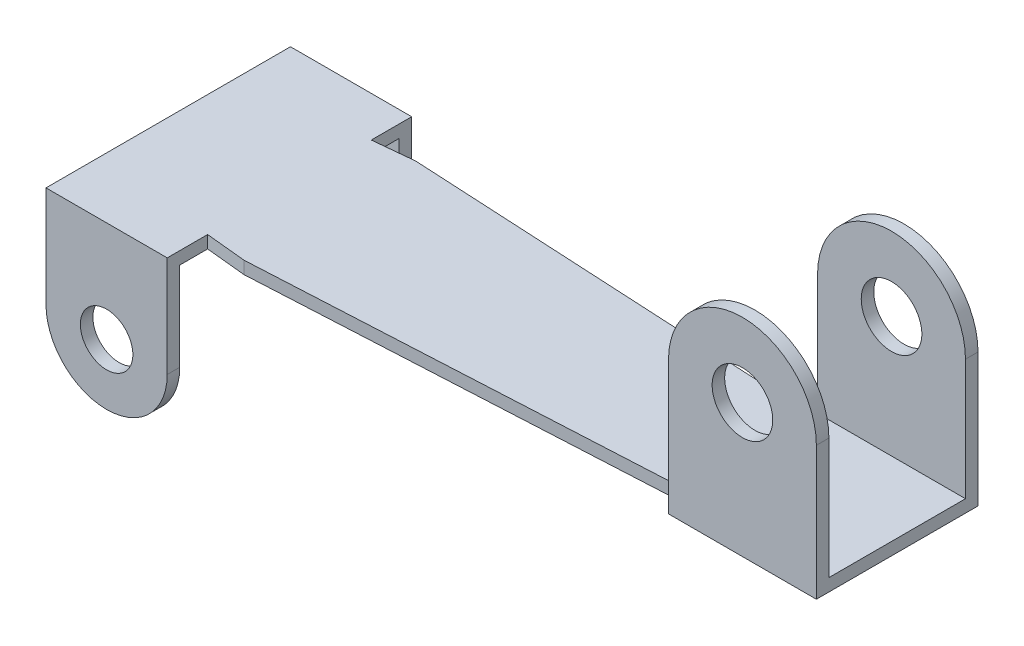
ISO-10303-21;
HEADER;
FILE_DESCRIPTION(('STEP AP214'),'2;1');
FILE_NAME('part.step','',(''),(''),'','','');
FILE_SCHEMA(('AUTOMOTIVE_DESIGN { 1 0 10303 214 1 1 1 1 }'));
ENDSEC;
DATA;
#1=APPLICATION_CONTEXT('core data for automotive mechanical design processes');
#2=APPLICATION_PROTOCOL_DEFINITION('international standard','automotive_design',2000,#1);
#3=PRODUCT_CONTEXT('',#1,'mechanical');
#4=PRODUCT('Part','Part','',(#3));
#5=PRODUCT_RELATED_PRODUCT_CATEGORY('part','',(#4));
#6=PRODUCT_DEFINITION_FORMATION('','',#4);
#7=PRODUCT_DEFINITION_CONTEXT('part definition',#1,'design');
#8=PRODUCT_DEFINITION('design','',#6,#7);
#9=PRODUCT_DEFINITION_SHAPE('','',#8);
#10=(LENGTH_UNIT() NAMED_UNIT(*) SI_UNIT(.MILLI.,.METRE.));
#11=(NAMED_UNIT(*) PLANE_ANGLE_UNIT() SI_UNIT($,.RADIAN.));
#12=(NAMED_UNIT(*) SI_UNIT($,.STERADIAN.) SOLID_ANGLE_UNIT());
#13=UNCERTAINTY_MEASURE_WITH_UNIT(LENGTH_MEASURE(1.E-05),#10,'distance_accuracy_value','');
#14=(GEOMETRIC_REPRESENTATION_CONTEXT(3) GLOBAL_UNCERTAINTY_ASSIGNED_CONTEXT((#13)) GLOBAL_UNIT_ASSIGNED_CONTEXT((#10,
#11,#12)) REPRESENTATION_CONTEXT('',''));
#15=CARTESIAN_POINT('',(0.,0.,0.));
#16=DIRECTION('',(0.,0.,1.));
#17=DIRECTION('',(1.,0.,0.));
#18=AXIS2_PLACEMENT_3D('',#15,#16,#17);
#19=CARTESIAN_POINT('',(14.38,0.31,2.));
#20=DIRECTION('',(1.,0.,0.));
#21=DIRECTION('',(0.,0.,-1.));
#22=AXIS2_PLACEMENT_3D('',#19,#20,#21);
#23=PLANE('',#22);
#24=DIRECTION('',(0.,0.,-1.));
#25=VECTOR('',#24,1.);
#26=CARTESIAN_POINT('',(14.38,3.3,2.82));
#27=LINE('',#26,#25);
#28=CARTESIAN_POINT('',(14.38,3.3,2.));
#29=VERTEX_POINT('',#28);
#30=CARTESIAN_POINT('',(14.38,3.3,1.69));
#31=VERTEX_POINT('',#30);
#32=EDGE_CURVE('E279',#29,#31,#27,.T.);
#33=ORIENTED_EDGE('',*,*,#32,.T.);
#34=DIRECTION('',(0.,-1.,0.));
#35=VECTOR('',#34,1.);
#36=CARTESIAN_POINT('',(14.38,5.13,1.69));
#37=LINE('',#36,#35);
#38=CARTESIAN_POINT('',(14.38,0.31,1.69));
#39=VERTEX_POINT('',#38);
#40=EDGE_CURVE('E133',#31,#39,#37,.T.);
#41=ORIENTED_EDGE('',*,*,#40,.T.);
#42=DIRECTION('',(0.,0.,1.));
#43=VECTOR('',#42,1.);
#44=CARTESIAN_POINT('',(14.38,0.31,2.));
#45=LINE('',#44,#43);
#46=CARTESIAN_POINT('',(14.38,0.31,1.575));
#47=VERTEX_POINT('',#46);
#48=EDGE_CURVE('E472',#47,#39,#45,.T.);
#49=ORIENTED_EDGE('',*,*,#48,.F.);
#50=DIRECTION('',(0.,-1.,0.));
#51=VECTOR('',#50,1.);
#52=CARTESIAN_POINT('',(14.38,0.31,1.575));
#53=LINE('',#52,#51);
#54=CARTESIAN_POINT('',(14.38,0.,1.575));
#55=VERTEX_POINT('',#54);
#56=EDGE_CURVE('E305',#47,#55,#53,.T.);
#57=ORIENTED_EDGE('',*,*,#56,.T.);
#58=DIRECTION('',(0.,0.,1.));
#59=VECTOR('',#58,1.);
#60=CARTESIAN_POINT('',(14.38,0.,2.));
#61=LINE('',#60,#59);
#62=CARTESIAN_POINT('',(14.38,0.,2.));
#63=VERTEX_POINT('',#62);
#64=EDGE_CURVE('E359',#55,#63,#61,.T.);
#65=ORIENTED_EDGE('',*,*,#64,.T.);
#66=DIRECTION('',(0.,-1.,0.));
#67=VECTOR('',#66,1.);
#68=CARTESIAN_POINT('',(14.38,0.31,2.));
#69=LINE('',#68,#67);
#70=EDGE_CURVE('E303',#29,#63,#69,.T.);
#71=ORIENTED_EDGE('',*,*,#70,.F.);
#72=EDGE_LOOP('',(#33,#41,#49,#57,#65,#71));
#73=FACE_BOUND('',#72,.T.);
#74=ADVANCED_FACE('F116',(#73),#23,.F.);
#75=CARTESIAN_POINT('',(14.38,0.31,-1.575));
#76=DIRECTION('',(1.,0.,0.));
#77=DIRECTION('',(0.,0.,-1.));
#78=AXIS2_PLACEMENT_3D('',#75,#76,#77);
#79=PLANE('',#78);
#80=CARTESIAN_POINT('',(14.38,3.3,-1.69));
#81=VERTEX_POINT('',#80);
#82=CARTESIAN_POINT('',(14.38,3.3,-2.));
#83=VERTEX_POINT('',#82);
#84=EDGE_CURVE('E273',#81,#83,#27,.T.);
#85=ORIENTED_EDGE('',*,*,#84,.T.);
#86=DIRECTION('',(0.,-1.,0.));
#87=VECTOR('',#86,1.);
#88=CARTESIAN_POINT('',(14.38,0.31,-2.));
#89=LINE('',#88,#87);
#90=CARTESIAN_POINT('',(14.38,0.,-2.));
#91=VERTEX_POINT('',#90);
#92=EDGE_CURVE('E283',#83,#91,#89,.T.);
#93=ORIENTED_EDGE('',*,*,#92,.T.);
#94=DIRECTION('',(0.,0.,1.));
#95=VECTOR('',#94,1.);
#96=CARTESIAN_POINT('',(14.38,0.,-1.575));
#97=LINE('',#96,#95);
#98=CARTESIAN_POINT('',(14.38,0.,-1.575));
#99=VERTEX_POINT('',#98);
#100=EDGE_CURVE('E369',#91,#99,#97,.T.);
#101=ORIENTED_EDGE('',*,*,#100,.T.);
#102=DIRECTION('',(0.,-1.,0.));
#103=VECTOR('',#102,1.);
#104=CARTESIAN_POINT('',(14.38,0.31,-1.575));
#105=LINE('',#104,#103);
#106=CARTESIAN_POINT('',(14.38,0.31,-1.575));
#107=VERTEX_POINT('',#106);
#108=EDGE_CURVE('E293',#107,#99,#105,.T.);
#109=ORIENTED_EDGE('',*,*,#108,.F.);
#110=DIRECTION('',(0.,0.,1.));
#111=VECTOR('',#110,1.);
#112=CARTESIAN_POINT('',(14.38,0.31,-1.575));
#113=LINE('',#112,#111);
#114=CARTESIAN_POINT('',(14.38,0.31,-1.69));
#115=VERTEX_POINT('',#114);
#116=EDGE_CURVE('E330',#115,#107,#113,.T.);
#117=ORIENTED_EDGE('',*,*,#116,.F.);
#118=DIRECTION('',(0.,-1.,0.));
#119=VECTOR('',#118,1.);
#120=CARTESIAN_POINT('',(14.38,5.13,-1.69));
#121=LINE('',#120,#119);
#122=EDGE_CURVE('E141',#81,#115,#121,.T.);
#123=ORIENTED_EDGE('',*,*,#122,.F.);
#124=EDGE_LOOP('',(#85,#93,#101,#109,#117,#123));
#125=FACE_BOUND('',#124,.T.);
#126=ADVANCED_FACE('F282',(#125),#79,.F.);
#127=CARTESIAN_POINT('',(0.,0.31,0.));
#128=DIRECTION('',(0.,-1.,0.));
#129=DIRECTION('',(0.,0.,-1.));
#130=AXIS2_PLACEMENT_3D('',#127,#128,#129);
#131=PLANE('',#130);
#132=DIRECTION('',(-1.,0.,0.));
#133=VECTOR('',#132,1.);
#134=CARTESIAN_POINT('',(14.38,0.31,1.69));
#135=LINE('',#134,#133);
#136=CARTESIAN_POINT('',(18.04,0.31,1.69));
#137=VERTEX_POINT('',#136);
#138=EDGE_CURVE('E595',#137,#39,#135,.T.);
#139=ORIENTED_EDGE('',*,*,#138,.F.);
#140=DIRECTION('',(0.,0.,-1.));
#141=VECTOR('',#140,1.);
#142=CARTESIAN_POINT('',(18.04,0.31,-2.));
#143=LINE('',#142,#141);
#144=CARTESIAN_POINT('',(18.04,0.31,-1.69));
#145=VERTEX_POINT('',#144);
#146=EDGE_CURVE('E334',#137,#145,#143,.T.);
#147=ORIENTED_EDGE('',*,*,#146,.T.);
#148=DIRECTION('',(1.,0.,0.));
#149=VECTOR('',#148,1.);
#150=CARTESIAN_POINT('',(14.38,0.31,-1.69));
#151=LINE('',#150,#149);
#152=EDGE_CURVE('E335',#115,#145,#151,.T.);
#153=ORIENTED_EDGE('',*,*,#152,.F.);
#154=ORIENTED_EDGE('',*,*,#116,.T.);
#155=DIRECTION('',(-0.998599163765983,0.,-0.0529122870974268));
#156=VECTOR('',#155,1.);
#157=CARTESIAN_POINT('',(4.,0.31,-2.125));
#158=LINE('',#157,#156);
#159=CARTESIAN_POINT('',(4.,0.31,-2.125));
#160=VERTEX_POINT('',#159);
#161=EDGE_CURVE('E333',#107,#160,#158,.T.);
#162=ORIENTED_EDGE('',*,*,#161,.T.);
#163=DIRECTION('',(-0.995037190209989,0.,0.0995037190209993));
#164=VECTOR('',#163,1.);
#165=CARTESIAN_POINT('',(3.,0.31,-2.025));
#166=LINE('',#165,#164);
#167=CARTESIAN_POINT('',(3.,0.31,-2.025));
#168=VERTEX_POINT('',#167);
#169=EDGE_CURVE('E344',#160,#168,#166,.T.);
#170=ORIENTED_EDGE('',*,*,#169,.T.);
#171=DIRECTION('',(0.,0.,-1.));
#172=VECTOR('',#171,1.);
#173=CARTESIAN_POINT('',(3.,0.31,-3.025));
#174=LINE('',#173,#172);
#175=CARTESIAN_POINT('',(3.,0.31,-3.025));
#176=VERTEX_POINT('',#175);
#177=EDGE_CURVE('E346',#168,#176,#174,.T.);
#178=ORIENTED_EDGE('',*,*,#177,.T.);
#179=DIRECTION('',(-1.,0.,0.));
#180=VECTOR('',#179,1.);
#181=CARTESIAN_POINT('',(0.,0.31,-3.025));
#182=LINE('',#181,#180);
#183=CARTESIAN_POINT('',(0.,0.31,-3.025));
#184=VERTEX_POINT('',#183);
#185=EDGE_CURVE('E378',#176,#184,#182,.T.);
#186=ORIENTED_EDGE('',*,*,#185,.T.);
#187=DIRECTION('',(0.,0.,1.));
#188=VECTOR('',#187,1.);
#189=CARTESIAN_POINT('',(0.,0.31,-3.025));
#190=LINE('',#189,#188);
#191=CARTESIAN_POINT('',(0.,0.31,3.025));
#192=VERTEX_POINT('',#191);
#193=EDGE_CURVE('E466',#184,#192,#190,.T.);
#194=ORIENTED_EDGE('',*,*,#193,.T.);
#195=DIRECTION('',(1.,0.,0.));
#196=VECTOR('',#195,1.);
#197=CARTESIAN_POINT('',(3.,0.31,3.025));
#198=LINE('',#197,#196);
#199=CARTESIAN_POINT('',(3.,0.31,3.025));
#200=VERTEX_POINT('',#199);
#201=EDGE_CURVE('E468',#192,#200,#198,.T.);
#202=ORIENTED_EDGE('',*,*,#201,.T.);
#203=DIRECTION('',(0.,0.,-1.));
#204=VECTOR('',#203,1.);
#205=CARTESIAN_POINT('',(3.,0.31,2.025));
#206=LINE('',#205,#204);
#207=CARTESIAN_POINT('',(3.,0.31,2.025));
#208=VERTEX_POINT('',#207);
#209=EDGE_CURVE('E445',#200,#208,#206,.T.);
#210=ORIENTED_EDGE('',*,*,#209,.T.);
#211=DIRECTION('',(0.995037190209989,0.,0.0995037190209993));
#212=VECTOR('',#211,1.);
#213=CARTESIAN_POINT('',(4.,0.31,2.125));
#214=LINE('',#213,#212);
#215=CARTESIAN_POINT('',(4.,0.31,2.125));
#216=VERTEX_POINT('',#215);
#217=EDGE_CURVE('E439',#208,#216,#214,.T.);
#218=ORIENTED_EDGE('',*,*,#217,.T.);
#219=DIRECTION('',(0.998599163765982,0.,-0.0529122870974268));
#220=VECTOR('',#219,1.);
#221=CARTESIAN_POINT('',(14.38,0.31,1.575));
#222=LINE('',#221,#220);
#223=EDGE_CURVE('E435',#216,#47,#222,.T.);
#224=ORIENTED_EDGE('',*,*,#223,.T.);
#225=ORIENTED_EDGE('',*,*,#48,.T.);
#226=EDGE_LOOP('',(#139,#147,#153,#154,#162,#170,#178,#186,#194,#202,#210,#218,#224,#225));
#227=FACE_BOUND('',#226,.T.);
#228=ADVANCED_FACE('F409',(#227),#131,.F.);
#229=CARTESIAN_POINT('',(0.,0.31,-3.025));
#230=DIRECTION('',(0.,0.,1.));
#231=DIRECTION('',(1.,0.,0.));
#232=AXIS2_PLACEMENT_3D('',#229,#230,#231);
#233=PLANE('',#232);
#234=CARTESIAN_POINT('',(1.5,-2.19,-3.025));
#235=DIRECTION('',(0.,0.,1.));
#236=DIRECTION('',(1.,0.,0.));
#237=AXIS2_PLACEMENT_3D('',#234,#235,#236);
#238=CIRCLE('',#237,0.65);
#239=CARTESIAN_POINT('',(2.15,-2.19,-3.025));
#240=VERTEX_POINT('',#239);
#241=EDGE_CURVE('E459',#240,#240,#238,.T.);
#242=ORIENTED_EDGE('',*,*,#241,.T.);
#243=EDGE_LOOP('',(#242));
#244=FACE_BOUND('',#243,.T.);
#245=CARTESIAN_POINT('',(1.5,-2.19,-3.025));
#246=DIRECTION('',(0.,0.,1.));
#247=DIRECTION('',(1.,0.,0.));
#248=AXIS2_PLACEMENT_3D('',#245,#246,#247);
#249=CIRCLE('',#248,1.5);
#250=CARTESIAN_POINT('',(0.,-2.19,-3.025));
#251=VERTEX_POINT('',#250);
#252=CARTESIAN_POINT('',(3.,-2.19,-3.025));
#253=VERTEX_POINT('',#252);
#254=EDGE_CURVE('E500',#251,#253,#249,.T.);
#255=ORIENTED_EDGE('',*,*,#254,.F.);
#256=DIRECTION('',(0.,-1.,0.));
#257=VECTOR('',#256,1.);
#258=CARTESIAN_POINT('',(0.,0.31,-3.025));
#259=LINE('',#258,#257);
#260=EDGE_CURVE('E320',#184,#251,#259,.T.);
#261=ORIENTED_EDGE('',*,*,#260,.F.);
#262=ORIENTED_EDGE('',*,*,#185,.F.);
#263=DIRECTION('',(0.,-1.,0.));
#264=VECTOR('',#263,1.);
#265=CARTESIAN_POINT('',(3.,0.31,-3.025));
#266=LINE('',#265,#264);
#267=EDGE_CURVE('E348',#176,#253,#266,.T.);
#268=ORIENTED_EDGE('',*,*,#267,.T.);
#269=EDGE_LOOP('',(#255,#261,#262,#268));
#270=FACE_BOUND('',#269,.T.);
#271=ADVANCED_FACE('F118',(#244,#270),#233,.F.);
#272=CARTESIAN_POINT('',(3.,0.31,3.025));
#273=DIRECTION('',(0.,0.,-1.));
#274=DIRECTION('',(-1.,0.,0.));
#275=AXIS2_PLACEMENT_3D('',#272,#273,#274);
#276=PLANE('',#275);
#277=CARTESIAN_POINT('',(1.5,-2.19,3.025));
#278=DIRECTION('',(0.,0.,1.));
#279=DIRECTION('',(1.,0.,0.));
#280=AXIS2_PLACEMENT_3D('',#277,#278,#279);
#281=CIRCLE('',#280,0.65);
#282=CARTESIAN_POINT('',(2.15,-2.19,3.025));
#283=VERTEX_POINT('',#282);
#284=EDGE_CURVE('E329',#283,#283,#281,.T.);
#285=ORIENTED_EDGE('',*,*,#284,.F.);
#286=EDGE_LOOP('',(#285));
#287=FACE_BOUND('',#286,.T.);
#288=DIRECTION('',(0.,-1.,0.));
#289=VECTOR('',#288,1.);
#290=CARTESIAN_POINT('',(0.,0.31,3.025));
#291=LINE('',#290,#289);
#292=CARTESIAN_POINT('',(0.,-2.19,3.025));
#293=VERTEX_POINT('',#292);
#294=EDGE_CURVE('E317',#192,#293,#291,.T.);
#295=ORIENTED_EDGE('',*,*,#294,.T.);
#296=CARTESIAN_POINT('',(1.5,-2.19,3.025));
#297=DIRECTION('',(0.,0.,1.));
#298=DIRECTION('',(1.,0.,0.));
#299=AXIS2_PLACEMENT_3D('',#296,#297,#298);
#300=CIRCLE('',#299,1.5);
#301=CARTESIAN_POINT('',(3.,-2.19,3.025));
#302=VERTEX_POINT('',#301);
#303=EDGE_CURVE('E487',#293,#302,#300,.T.);
#304=ORIENTED_EDGE('',*,*,#303,.T.);
#305=DIRECTION('',(0.,-1.,0.));
#306=VECTOR('',#305,1.);
#307=CARTESIAN_POINT('',(3.,0.31,3.025));
#308=LINE('',#307,#306);
#309=EDGE_CURVE('E314',#200,#302,#308,.T.);
#310=ORIENTED_EDGE('',*,*,#309,.F.);
#311=ORIENTED_EDGE('',*,*,#201,.F.);
#312=EDGE_LOOP('',(#295,#304,#310,#311));
#313=FACE_BOUND('',#312,.T.);
#314=ADVANCED_FACE('F541',(#287,#313),#276,.F.);
#315=CARTESIAN_POINT('',(0.,-3.69,-2.715));
#316=DIRECTION('',(0.,0.,1.));
#317=DIRECTION('',(1.,0.,0.));
#318=AXIS2_PLACEMENT_3D('',#315,#316,#317);
#319=PLANE('',#318);
#320=CARTESIAN_POINT('',(1.5,-2.19,-2.715));
#321=DIRECTION('',(0.,0.,1.));
#322=DIRECTION('',(1.,0.,0.));
#323=AXIS2_PLACEMENT_3D('',#320,#321,#322);
#324=CIRCLE('',#323,0.65);
#325=CARTESIAN_POINT('',(2.15,-2.19,-2.715));
#326=VERTEX_POINT('',#325);
#327=EDGE_CURVE('E328',#326,#326,#324,.T.);
#328=ORIENTED_EDGE('',*,*,#327,.F.);
#329=EDGE_LOOP('',(#328));
#330=FACE_BOUND('',#329,.T.);
#331=DIRECTION('',(0.,1.,0.));
#332=VECTOR('',#331,1.);
#333=CARTESIAN_POINT('',(0.,-3.69,-2.715));
#334=LINE('',#333,#332);
#335=CARTESIAN_POINT('',(0.,-2.19,-2.715));
#336=VERTEX_POINT('',#335);
#337=CARTESIAN_POINT('',(0.,0.,-2.715));
#338=VERTEX_POINT('',#337);
#339=EDGE_CURVE('E456',#336,#338,#334,.T.);
#340=ORIENTED_EDGE('',*,*,#339,.F.);
#341=CARTESIAN_POINT('',(1.5,-2.19,-2.715));
#342=DIRECTION('',(0.,0.,1.));
#343=DIRECTION('',(1.,0.,0.));
#344=AXIS2_PLACEMENT_3D('',#341,#342,#343);
#345=CIRCLE('',#344,1.5);
#346=CARTESIAN_POINT('',(3.,-2.19,-2.715));
#347=VERTEX_POINT('',#346);
#348=EDGE_CURVE('E497',#336,#347,#345,.T.);
#349=ORIENTED_EDGE('',*,*,#348,.T.);
#350=DIRECTION('',(0.,1.,0.));
#351=VECTOR('',#350,1.);
#352=CARTESIAN_POINT('',(3.,-3.69,-2.715));
#353=LINE('',#352,#351);
#354=CARTESIAN_POINT('',(3.,0.,-2.715));
#355=VERTEX_POINT('',#354);
#356=EDGE_CURVE('E353',#347,#355,#353,.T.);
#357=ORIENTED_EDGE('',*,*,#356,.T.);
#358=DIRECTION('',(-1.,0.,0.));
#359=VECTOR('',#358,1.);
#360=CARTESIAN_POINT('',(0.,0.,-2.715));
#361=LINE('',#360,#359);
#362=EDGE_CURVE('E125',#355,#338,#361,.T.);
#363=ORIENTED_EDGE('',*,*,#362,.T.);
#364=EDGE_LOOP('',(#340,#349,#357,#363));
#365=FACE_BOUND('',#364,.T.);
#366=ADVANCED_FACE('F543',(#330,#365),#319,.T.);
#367=CARTESIAN_POINT('',(3.,-3.69,2.715));
#368=DIRECTION('',(0.,0.,-1.));
#369=DIRECTION('',(-1.,0.,0.));
#370=AXIS2_PLACEMENT_3D('',#367,#368,#369);
#371=PLANE('',#370);
#372=CARTESIAN_POINT('',(1.5,-2.19,2.715));
#373=DIRECTION('',(0.,0.,-1.));
#374=DIRECTION('',(-1.,0.,0.));
#375=AXIS2_PLACEMENT_3D('',#372,#373,#374);
#376=CIRCLE('',#375,0.65);
#377=CARTESIAN_POINT('',(0.850000000000001,-2.19,2.715));
#378=VERTEX_POINT('',#377);
#379=EDGE_CURVE('E325',#378,#378,#376,.T.);
#380=ORIENTED_EDGE('',*,*,#379,.F.);
#381=EDGE_LOOP('',(#380));
#382=FACE_BOUND('',#381,.T.);
#383=CARTESIAN_POINT('',(1.5,-2.19,2.715));
#384=DIRECTION('',(0.,0.,-1.));
#385=DIRECTION('',(-1.,0.,0.));
#386=AXIS2_PLACEMENT_3D('',#383,#384,#385);
#387=CIRCLE('',#386,1.5);
#388=CARTESIAN_POINT('',(3.,-2.19,2.715));
#389=VERTEX_POINT('',#388);
#390=CARTESIAN_POINT('',(0.,-2.19,2.715));
#391=VERTEX_POINT('',#390);
#392=EDGE_CURVE('E452',#389,#391,#387,.T.);
#393=ORIENTED_EDGE('',*,*,#392,.T.);
#394=DIRECTION('',(0.,1.,0.));
#395=VECTOR('',#394,1.);
#396=CARTESIAN_POINT('',(0.,-3.69,2.715));
#397=LINE('',#396,#395);
#398=CARTESIAN_POINT('',(0.,0.,2.715));
#399=VERTEX_POINT('',#398);
#400=EDGE_CURVE('E451',#391,#399,#397,.T.);
#401=ORIENTED_EDGE('',*,*,#400,.T.);
#402=DIRECTION('',(1.,0.,0.));
#403=VECTOR('',#402,1.);
#404=CARTESIAN_POINT('',(0.,0.,2.715));
#405=LINE('',#404,#403);
#406=CARTESIAN_POINT('',(3.,0.,2.715));
#407=VERTEX_POINT('',#406);
#408=EDGE_CURVE('E12',#399,#407,#405,.T.);
#409=ORIENTED_EDGE('',*,*,#408,.T.);
#410=DIRECTION('',(0.,1.,0.));
#411=VECTOR('',#410,1.);
#412=CARTESIAN_POINT('',(3.,-3.69,2.715));
#413=LINE('',#412,#411);
#414=EDGE_CURVE('E447',#389,#407,#413,.T.);
#415=ORIENTED_EDGE('',*,*,#414,.F.);
#416=EDGE_LOOP('',(#393,#401,#409,#415));
#417=FACE_BOUND('',#416,.T.);
#418=ADVANCED_FACE('F449',(#382,#417),#371,.T.);
#419=CARTESIAN_POINT('',(3.,0.31,2.025));
#420=DIRECTION('',(-1.,0.,0.));
#421=DIRECTION('',(0.,0.,1.));
#422=AXIS2_PLACEMENT_3D('',#419,#420,#421);
#423=PLANE('',#422);
#424=DIRECTION('',(0.,0.,1.));
#425=VECTOR('',#424,1.);
#426=CARTESIAN_POINT('',(3.,-2.19,-7.975));
#427=LINE('',#426,#425);
#428=EDGE_CURVE('E493',#389,#302,#427,.T.);
#429=ORIENTED_EDGE('',*,*,#428,.F.);
#430=ORIENTED_EDGE('',*,*,#414,.T.);
#431=DIRECTION('',(0.,0.,-1.));
#432=VECTOR('',#431,1.);
#433=CARTESIAN_POINT('',(3.,0.,2.025));
#434=LINE('',#433,#432);
#435=CARTESIAN_POINT('',(3.,0.,2.025));
#436=VERTEX_POINT('',#435);
#437=EDGE_CURVE('E352',#407,#436,#434,.T.);
#438=ORIENTED_EDGE('',*,*,#437,.T.);
#439=DIRECTION('',(0.,-1.,0.));
#440=VECTOR('',#439,1.);
#441=CARTESIAN_POINT('',(3.,0.31,2.025));
#442=LINE('',#441,#440);
#443=EDGE_CURVE('E311',#208,#436,#442,.T.);
#444=ORIENTED_EDGE('',*,*,#443,.F.);
#445=ORIENTED_EDGE('',*,*,#209,.F.);
#446=ORIENTED_EDGE('',*,*,#309,.T.);
#447=EDGE_LOOP('',(#429,#430,#438,#444,#445,#446));
#448=FACE_BOUND('',#447,.T.);
#449=ADVANCED_FACE('F444',(#448),#423,.F.);
#450=CARTESIAN_POINT('',(3.,0.31,-3.025));
#451=DIRECTION('',(-1.,0.,0.));
#452=DIRECTION('',(0.,0.,1.));
#453=AXIS2_PLACEMENT_3D('',#450,#451,#452);
#454=PLANE('',#453);
#455=EDGE_CURVE('E495',#253,#347,#427,.T.);
#456=ORIENTED_EDGE('',*,*,#455,.F.);
#457=ORIENTED_EDGE('',*,*,#267,.F.);
#458=ORIENTED_EDGE('',*,*,#177,.F.);
#459=DIRECTION('',(0.,-1.,0.));
#460=VECTOR('',#459,1.);
#461=CARTESIAN_POINT('',(3.,0.31,-2.025));
#462=LINE('',#461,#460);
#463=CARTESIAN_POINT('',(3.,0.,-2.025));
#464=VERTEX_POINT('',#463);
#465=EDGE_CURVE('E381',#168,#464,#462,.T.);
#466=ORIENTED_EDGE('',*,*,#465,.T.);
#467=DIRECTION('',(0.,0.,-1.));
#468=VECTOR('',#467,1.);
#469=CARTESIAN_POINT('',(3.,0.,-3.025));
#470=LINE('',#469,#468);
#471=EDGE_CURVE('E375',#464,#355,#470,.T.);
#472=ORIENTED_EDGE('',*,*,#471,.T.);
#473=ORIENTED_EDGE('',*,*,#356,.F.);
#474=EDGE_LOOP('',(#456,#457,#458,#466,#472,#473));
#475=FACE_BOUND('',#474,.T.);
#476=ADVANCED_FACE('F402',(#475),#454,.F.);
#477=CARTESIAN_POINT('',(0.,0.31,-3.025));
#478=DIRECTION('',(1.,0.,0.));
#479=DIRECTION('',(0.,0.,-1.));
#480=AXIS2_PLACEMENT_3D('',#477,#478,#479);
#481=PLANE('',#480);
#482=ORIENTED_EDGE('',*,*,#260,.T.);
#483=DIRECTION('',(0.,0.,1.));
#484=VECTOR('',#483,1.);
#485=CARTESIAN_POINT('',(0.,-2.19,-7.975));
#486=LINE('',#485,#484);
#487=EDGE_CURVE('E483',#251,#336,#486,.T.);
#488=ORIENTED_EDGE('',*,*,#487,.T.);
#489=ORIENTED_EDGE('',*,*,#339,.T.);
#490=DIRECTION('',(0.,0.,1.));
#491=VECTOR('',#490,1.);
#492=CARTESIAN_POINT('',(0.,0.,-3.025));
#493=LINE('',#492,#491);
#494=EDGE_CURVE('E349',#338,#399,#493,.T.);
#495=ORIENTED_EDGE('',*,*,#494,.T.);
#496=ORIENTED_EDGE('',*,*,#400,.F.);
#497=EDGE_CURVE('E482',#391,#293,#486,.T.);
#498=ORIENTED_EDGE('',*,*,#497,.T.);
#499=ORIENTED_EDGE('',*,*,#294,.F.);
#500=ORIENTED_EDGE('',*,*,#193,.F.);
#501=EDGE_LOOP('',(#482,#488,#489,#495,#496,#498,#499,#500));
#502=FACE_BOUND('',#501,.T.);
#503=ADVANCED_FACE('F538',(#502),#481,.F.);
#504=CARTESIAN_POINT('',(4.,0.31,2.125));
#505=DIRECTION('',(0.0995037190209992,0.,-0.995037190209989));
#506=DIRECTION('',(-0.995037190209989,0.,-0.0995037190209993));
#507=AXIS2_PLACEMENT_3D('',#504,#505,#506);
#508=PLANE('',#507);
#509=DIRECTION('',(0.995037190209989,0.,0.0995037190209993));
#510=VECTOR('',#509,1.);
#511=CARTESIAN_POINT('',(4.,0.,2.125));
#512=LINE('',#511,#510);
#513=CARTESIAN_POINT('',(4.,0.,2.125));
#514=VERTEX_POINT('',#513);
#515=EDGE_CURVE('E355',#436,#514,#512,.T.);
#516=ORIENTED_EDGE('',*,*,#515,.T.);
#517=DIRECTION('',(0.,-1.,0.));
#518=VECTOR('',#517,1.);
#519=CARTESIAN_POINT('',(4.,0.31,2.125));
#520=LINE('',#519,#518);
#521=EDGE_CURVE('E308',#216,#514,#520,.T.);
#522=ORIENTED_EDGE('',*,*,#521,.F.);
#523=ORIENTED_EDGE('',*,*,#217,.F.);
#524=ORIENTED_EDGE('',*,*,#443,.T.);
#525=EDGE_LOOP('',(#516,#522,#523,#524));
#526=FACE_BOUND('',#525,.T.);
#527=ADVANCED_FACE('F438',(#526),#508,.F.);
#528=CARTESIAN_POINT('',(14.38,0.31,1.575));
#529=DIRECTION('',(-0.0529122870974268,0.,-0.998599163765983));
#530=DIRECTION('',(-0.998599163765983,0.,0.0529122870974268));
#531=AXIS2_PLACEMENT_3D('',#528,#529,#530);
#532=PLANE('',#531);
#533=DIRECTION('',(0.998599163765982,0.,-0.0529122870974268));
#534=VECTOR('',#533,1.);
#535=CARTESIAN_POINT('',(14.38,0.,1.575));
#536=LINE('',#535,#534);
#537=EDGE_CURVE('E357',#514,#55,#536,.T.);
#538=ORIENTED_EDGE('',*,*,#537,.T.);
#539=ORIENTED_EDGE('',*,*,#56,.F.);
#540=ORIENTED_EDGE('',*,*,#223,.F.);
#541=ORIENTED_EDGE('',*,*,#521,.T.);
#542=EDGE_LOOP('',(#538,#539,#540,#541));
#543=FACE_BOUND('',#542,.T.);
#544=ADVANCED_FACE('F432',(#543),#532,.F.);
#545=CARTESIAN_POINT('',(18.04,0.31,2.));
#546=DIRECTION('',(0.,0.,-1.));
#547=DIRECTION('',(-1.,0.,0.));
#548=AXIS2_PLACEMENT_3D('',#545,#546,#547);
#549=PLANE('',#548);
#550=CARTESIAN_POINT('',(16.21,3.3,2.));
#551=DIRECTION('',(0.,0.,-1.));
#552=DIRECTION('',(-1.,0.,0.));
#553=AXIS2_PLACEMENT_3D('',#550,#551,#552);
#554=CIRCLE('',#553,0.75);
#555=CARTESIAN_POINT('',(15.46,3.3,2.));
#556=VERTEX_POINT('',#555);
#557=EDGE_CURVE('E286',#556,#556,#554,.T.);
#558=ORIENTED_EDGE('',*,*,#557,.T.);
#559=EDGE_LOOP('',(#558));
#560=FACE_BOUND('',#559,.T.);
#561=CARTESIAN_POINT('',(16.21,3.3,2.));
#562=DIRECTION('',(0.,0.,-1.));
#563=DIRECTION('',(-1.,0.,0.));
#564=AXIS2_PLACEMENT_3D('',#561,#562,#563);
#565=CIRCLE('',#564,1.83);
#566=CARTESIAN_POINT('',(18.04,3.3,2.));
#567=VERTEX_POINT('',#566);
#568=EDGE_CURVE('E425',#567,#29,#565,.F.);
#569=ORIENTED_EDGE('',*,*,#568,.T.);
#570=ORIENTED_EDGE('',*,*,#70,.T.);
#571=DIRECTION('',(1.,0.,0.));
#572=VECTOR('',#571,1.);
#573=CARTESIAN_POINT('',(18.04,0.,2.));
#574=LINE('',#573,#572);
#575=CARTESIAN_POINT('',(18.04,0.,2.));
#576=VERTEX_POINT('',#575);
#577=EDGE_CURVE('E362',#63,#576,#574,.T.);
#578=ORIENTED_EDGE('',*,*,#577,.T.);
#579=DIRECTION('',(0.,-1.,0.));
#580=VECTOR('',#579,1.);
#581=CARTESIAN_POINT('',(18.04,0.31,2.));
#582=LINE('',#581,#580);
#583=EDGE_CURVE('E295',#567,#576,#582,.T.);
#584=ORIENTED_EDGE('',*,*,#583,.F.);
#585=EDGE_LOOP('',(#569,#570,#578,#584));
#586=FACE_BOUND('',#585,.T.);
#587=ADVANCED_FACE('F423',(#560,#586),#549,.F.);
#588=CARTESIAN_POINT('',(18.04,0.31,-2.));
#589=DIRECTION('',(-1.,0.,0.));
#590=DIRECTION('',(0.,0.,1.));
#591=AXIS2_PLACEMENT_3D('',#588,#589,#590);
#592=PLANE('',#591);
#593=DIRECTION('',(0.,-1.,0.));
#594=VECTOR('',#593,1.);
#595=CARTESIAN_POINT('',(18.04,0.31,-2.));
#596=LINE('',#595,#594);
#597=CARTESIAN_POINT('',(18.04,3.3,-2.));
#598=VERTEX_POINT('',#597);
#599=CARTESIAN_POINT('',(18.04,0.,-2.));
#600=VERTEX_POINT('',#599);
#601=EDGE_CURVE('E292',#598,#600,#596,.T.);
#602=ORIENTED_EDGE('',*,*,#601,.F.);
#603=DIRECTION('',(0.,0.,-1.));
#604=VECTOR('',#603,1.);
#605=CARTESIAN_POINT('',(18.04,3.3,2.82));
#606=LINE('',#605,#604);
#607=CARTESIAN_POINT('',(18.04,3.3,-1.69));
#608=VERTEX_POINT('',#607);
#609=EDGE_CURVE('E275',#608,#598,#606,.T.);
#610=ORIENTED_EDGE('',*,*,#609,.F.);
#611=DIRECTION('',(0.,-1.,0.));
#612=VECTOR('',#611,1.);
#613=CARTESIAN_POINT('',(18.04,5.13,-1.69));
#614=LINE('',#613,#612);
#615=EDGE_CURVE('E480',#608,#145,#614,.T.);
#616=ORIENTED_EDGE('',*,*,#615,.T.);
#617=ORIENTED_EDGE('',*,*,#146,.F.);
#618=DIRECTION('',(0.,-1.,0.));
#619=VECTOR('',#618,1.);
#620=CARTESIAN_POINT('',(18.04,5.13,1.69));
#621=LINE('',#620,#619);
#622=CARTESIAN_POINT('',(18.04,3.3,1.69));
#623=VERTEX_POINT('',#622);
#624=EDGE_CURVE('E597',#623,#137,#621,.T.);
#625=ORIENTED_EDGE('',*,*,#624,.F.);
#626=EDGE_CURVE('E421',#567,#623,#606,.T.);
#627=ORIENTED_EDGE('',*,*,#626,.F.);
#628=ORIENTED_EDGE('',*,*,#583,.T.);
#629=DIRECTION('',(0.,0.,-1.));
#630=VECTOR('',#629,1.);
#631=CARTESIAN_POINT('',(18.04,0.,-2.));
#632=LINE('',#631,#630);
#633=EDGE_CURVE('E365',#576,#600,#632,.T.);
#634=ORIENTED_EDGE('',*,*,#633,.T.);
#635=EDGE_LOOP('',(#602,#610,#616,#617,#625,#627,#628,#634));
#636=FACE_BOUND('',#635,.T.);
#637=ADVANCED_FACE('F417',(#636),#592,.F.);
#638=CARTESIAN_POINT('',(14.38,0.31,-2.));
#639=DIRECTION('',(0.,0.,1.));
#640=DIRECTION('',(1.,0.,0.));
#641=AXIS2_PLACEMENT_3D('',#638,#639,#640);
#642=PLANE('',#641);
#643=CARTESIAN_POINT('',(16.21,3.3,-2.));
#644=DIRECTION('',(0.,0.,-1.));
#645=DIRECTION('',(-1.,0.,0.));
#646=AXIS2_PLACEMENT_3D('',#643,#644,#645);
#647=CIRCLE('',#646,0.75);
#648=CARTESIAN_POINT('',(15.46,3.3,-2.));
#649=VERTEX_POINT('',#648);
#650=EDGE_CURVE('E631',#649,#649,#647,.T.);
#651=ORIENTED_EDGE('',*,*,#650,.F.);
#652=EDGE_LOOP('',(#651));
#653=FACE_BOUND('',#652,.T.);
#654=ORIENTED_EDGE('',*,*,#92,.F.);
#655=CARTESIAN_POINT('',(16.21,3.3,-2.));
#656=DIRECTION('',(0.,0.,-1.));
#657=DIRECTION('',(-1.,0.,0.));
#658=AXIS2_PLACEMENT_3D('',#655,#656,#657);
#659=CIRCLE('',#658,1.83);
#660=EDGE_CURVE('E270',#598,#83,#659,.F.);
#661=ORIENTED_EDGE('',*,*,#660,.F.);
#662=ORIENTED_EDGE('',*,*,#601,.T.);
#663=DIRECTION('',(-1.,0.,0.));
#664=VECTOR('',#663,1.);
#665=CARTESIAN_POINT('',(14.38,0.,-2.));
#666=LINE('',#665,#664);
#667=EDGE_CURVE('E290',#600,#91,#666,.T.);
#668=ORIENTED_EDGE('',*,*,#667,.T.);
#669=EDGE_LOOP('',(#654,#661,#662,#668));
#670=FACE_BOUND('',#669,.T.);
#671=ADVANCED_FACE('F288',(#653,#670),#642,.F.);
#672=CARTESIAN_POINT('',(4.,0.31,-2.125));
#673=DIRECTION('',(-0.0529122870974268,0.,0.998599163765983));
#674=DIRECTION('',(0.998599163765983,0.,0.0529122870974268));
#675=AXIS2_PLACEMENT_3D('',#672,#673,#674);
#676=PLANE('',#675);
#677=DIRECTION('',(-0.998599163765983,0.,-0.0529122870974268));
#678=VECTOR('',#677,1.);
#679=CARTESIAN_POINT('',(4.,0.,-2.125));
#680=LINE('',#679,#678);
#681=CARTESIAN_POINT('',(4.,0.,-2.125));
#682=VERTEX_POINT('',#681);
#683=EDGE_CURVE('E371',#99,#682,#680,.T.);
#684=ORIENTED_EDGE('',*,*,#683,.T.);
#685=DIRECTION('',(0.,-1.,0.));
#686=VECTOR('',#685,1.);
#687=CARTESIAN_POINT('',(4.,0.31,-2.125));
#688=LINE('',#687,#686);
#689=EDGE_CURVE('E298',#160,#682,#688,.T.);
#690=ORIENTED_EDGE('',*,*,#689,.F.);
#691=ORIENTED_EDGE('',*,*,#161,.F.);
#692=ORIENTED_EDGE('',*,*,#108,.T.);
#693=EDGE_LOOP('',(#684,#690,#691,#692));
#694=FACE_BOUND('',#693,.T.);
#695=ADVANCED_FACE('F412',(#694),#676,.F.);
#696=CARTESIAN_POINT('',(3.,0.31,-2.025));
#697=DIRECTION('',(0.0995037190209992,0.,0.995037190209989));
#698=DIRECTION('',(0.995037190209989,0.,-0.0995037190209993));
#699=AXIS2_PLACEMENT_3D('',#696,#697,#698);
#700=PLANE('',#699);
#701=DIRECTION('',(-0.995037190209989,0.,0.0995037190209993));
#702=VECTOR('',#701,1.);
#703=CARTESIAN_POINT('',(3.,0.,-2.025));
#704=LINE('',#703,#702);
#705=EDGE_CURVE('E373',#682,#464,#704,.T.);
#706=ORIENTED_EDGE('',*,*,#705,.T.);
#707=ORIENTED_EDGE('',*,*,#465,.F.);
#708=ORIENTED_EDGE('',*,*,#169,.F.);
#709=ORIENTED_EDGE('',*,*,#689,.T.);
#710=EDGE_LOOP('',(#706,#707,#708,#709));
#711=FACE_BOUND('',#710,.T.);
#712=ADVANCED_FACE('F388',(#711),#700,.F.);
#713=CARTESIAN_POINT('',(0.,0.,0.));
#714=DIRECTION('',(0.,-1.,0.));
#715=DIRECTION('',(0.,0.,-1.));
#716=AXIS2_PLACEMENT_3D('',#713,#714,#715);
#717=PLANE('',#716);
#718=ORIENTED_EDGE('',*,*,#408,.F.);
#719=ORIENTED_EDGE('',*,*,#494,.F.);
#720=ORIENTED_EDGE('',*,*,#362,.F.);
#721=ORIENTED_EDGE('',*,*,#471,.F.);
#722=ORIENTED_EDGE('',*,*,#705,.F.);
#723=ORIENTED_EDGE('',*,*,#683,.F.);
#724=ORIENTED_EDGE('',*,*,#100,.F.);
#725=ORIENTED_EDGE('',*,*,#667,.F.);
#726=ORIENTED_EDGE('',*,*,#633,.F.);
#727=ORIENTED_EDGE('',*,*,#577,.F.);
#728=ORIENTED_EDGE('',*,*,#64,.F.);
#729=ORIENTED_EDGE('',*,*,#537,.F.);
#730=ORIENTED_EDGE('',*,*,#515,.F.);
#731=ORIENTED_EDGE('',*,*,#437,.F.);
#732=EDGE_LOOP('',(#718,#719,#720,#721,#722,#723,#724,#725,#726,#727,#728,#729,#730,#731));
#733=FACE_BOUND('',#732,.T.);
#734=ADVANCED_FACE('F396',(#733),#717,.T.);
#735=CARTESIAN_POINT('',(1.5,-2.19,-7.975));
#736=DIRECTION('',(0.,0.,1.));
#737=DIRECTION('',(1.,0.,0.));
#738=AXIS2_PLACEMENT_3D('',#735,#736,#737);
#739=CYLINDRICAL_SURFACE('',#738,0.65);
#740=ORIENTED_EDGE('',*,*,#379,.T.);
#741=EDGE_LOOP('',(#740));
#742=FACE_BOUND('',#741,.T.);
#743=ORIENTED_EDGE('',*,*,#284,.T.);
#744=EDGE_LOOP('',(#743));
#745=FACE_BOUND('',#744,.T.);
#746=ADVANCED_FACE('F514',(#742,#745),#739,.F.);
#747=ORIENTED_EDGE('',*,*,#327,.T.);
#748=EDGE_LOOP('',(#747));
#749=FACE_BOUND('',#748,.T.);
#750=ORIENTED_EDGE('',*,*,#241,.F.);
#751=EDGE_LOOP('',(#750));
#752=FACE_BOUND('',#751,.T.);
#753=ADVANCED_FACE('F511',(#749,#752),#739,.F.);
#754=CARTESIAN_POINT('',(1.5,-2.19,-7.975));
#755=DIRECTION('',(0.,0.,1.));
#756=DIRECTION('',(1.,0.,0.));
#757=AXIS2_PLACEMENT_3D('',#754,#755,#756);
#758=CYLINDRICAL_SURFACE('',#757,1.5);
#759=ORIENTED_EDGE('',*,*,#428,.T.);
#760=ORIENTED_EDGE('',*,*,#303,.F.);
#761=ORIENTED_EDGE('',*,*,#497,.F.);
#762=ORIENTED_EDGE('',*,*,#392,.F.);
#763=EDGE_LOOP('',(#759,#760,#761,#762));
#764=FACE_BOUND('',#763,.T.);
#765=ADVANCED_FACE('F513',(#764),#758,.T.);
#766=ORIENTED_EDGE('',*,*,#254,.T.);
#767=ORIENTED_EDGE('',*,*,#455,.T.);
#768=ORIENTED_EDGE('',*,*,#348,.F.);
#769=ORIENTED_EDGE('',*,*,#487,.F.);
#770=EDGE_LOOP('',(#766,#767,#768,#769));
#771=FACE_BOUND('',#770,.T.);
#772=ADVANCED_FACE('F520',(#771),#758,.T.);
#773=CARTESIAN_POINT('',(14.38,5.13,-1.69));
#774=DIRECTION('',(0.,0.,-1.));
#775=DIRECTION('',(-1.,0.,0.));
#776=AXIS2_PLACEMENT_3D('',#773,#774,#775);
#777=PLANE('',#776);
#778=CARTESIAN_POINT('',(16.21,3.3,-1.69));
#779=DIRECTION('',(0.,0.,-1.));
#780=DIRECTION('',(-1.,0.,0.));
#781=AXIS2_PLACEMENT_3D('',#778,#779,#780);
#782=CIRCLE('',#781,0.75);
#783=CARTESIAN_POINT('',(15.46,3.3,-1.69));
#784=VERTEX_POINT('',#783);
#785=EDGE_CURVE('E582',#784,#784,#782,.T.);
#786=ORIENTED_EDGE('',*,*,#785,.T.);
#787=EDGE_LOOP('',(#786));
#788=FACE_BOUND('',#787,.T.);
#789=CARTESIAN_POINT('',(16.21,3.3,-1.69));
#790=DIRECTION('',(0.,0.,-1.));
#791=DIRECTION('',(-1.,0.,0.));
#792=AXIS2_PLACEMENT_3D('',#789,#790,#791);
#793=CIRCLE('',#792,1.83);
#794=EDGE_CURVE('E592',#608,#81,#793,.F.);
#795=ORIENTED_EDGE('',*,*,#794,.T.);
#796=ORIENTED_EDGE('',*,*,#122,.T.);
#797=ORIENTED_EDGE('',*,*,#152,.T.);
#798=ORIENTED_EDGE('',*,*,#615,.F.);
#799=EDGE_LOOP('',(#795,#796,#797,#798));
#800=FACE_BOUND('',#799,.T.);
#801=ADVANCED_FACE('F600',(#788,#800),#777,.F.);
#802=CARTESIAN_POINT('',(14.38,5.13,1.69));
#803=DIRECTION('',(0.,0.,1.));
#804=DIRECTION('',(1.,0.,0.));
#805=AXIS2_PLACEMENT_3D('',#802,#803,#804);
#806=PLANE('',#805);
#807=CARTESIAN_POINT('',(16.21,3.3,1.69));
#808=DIRECTION('',(0.,0.,1.));
#809=DIRECTION('',(1.,0.,0.));
#810=AXIS2_PLACEMENT_3D('',#807,#808,#809);
#811=CIRCLE('',#810,0.75);
#812=CARTESIAN_POINT('',(16.96,3.3,1.69));
#813=VERTEX_POINT('',#812);
#814=EDGE_CURVE('E120',#813,#813,#811,.T.);
#815=ORIENTED_EDGE('',*,*,#814,.T.);
#816=EDGE_LOOP('',(#815));
#817=FACE_BOUND('',#816,.T.);
#818=ORIENTED_EDGE('',*,*,#40,.F.);
#819=CARTESIAN_POINT('',(16.21,3.3,1.69));
#820=DIRECTION('',(0.,0.,1.));
#821=DIRECTION('',(1.,0.,0.));
#822=AXIS2_PLACEMENT_3D('',#819,#820,#821);
#823=CIRCLE('',#822,1.83);
#824=EDGE_CURVE('E589',#31,#623,#823,.F.);
#825=ORIENTED_EDGE('',*,*,#824,.T.);
#826=ORIENTED_EDGE('',*,*,#624,.T.);
#827=ORIENTED_EDGE('',*,*,#138,.T.);
#828=EDGE_LOOP('',(#818,#825,#826,#827));
#829=FACE_BOUND('',#828,.T.);
#830=ADVANCED_FACE('F601',(#817,#829),#806,.F.);
#831=CARTESIAN_POINT('',(16.21,3.3,2.82));
#832=DIRECTION('',(0.,0.,-1.));
#833=DIRECTION('',(-1.,0.,0.));
#834=AXIS2_PLACEMENT_3D('',#831,#832,#833);
#835=CYLINDRICAL_SURFACE('',#834,1.83);
#836=ORIENTED_EDGE('',*,*,#626,.T.);
#837=ORIENTED_EDGE('',*,*,#824,.F.);
#838=ORIENTED_EDGE('',*,*,#32,.F.);
#839=ORIENTED_EDGE('',*,*,#568,.F.);
#840=EDGE_LOOP('',(#836,#837,#838,#839));
#841=FACE_BOUND('',#840,.T.);
#842=ADVANCED_FACE('F603',(#841),#835,.T.);
#843=ORIENTED_EDGE('',*,*,#609,.T.);
#844=ORIENTED_EDGE('',*,*,#660,.T.);
#845=ORIENTED_EDGE('',*,*,#84,.F.);
#846=ORIENTED_EDGE('',*,*,#794,.F.);
#847=EDGE_LOOP('',(#843,#844,#845,#846));
#848=FACE_BOUND('',#847,.T.);
#849=ADVANCED_FACE('F272',(#848),#835,.T.);
#850=CARTESIAN_POINT('',(16.21,3.3,2.82));
#851=DIRECTION('',(0.,0.,-1.));
#852=DIRECTION('',(-1.,0.,0.));
#853=AXIS2_PLACEMENT_3D('',#850,#851,#852);
#854=CYLINDRICAL_SURFACE('',#853,0.75);
#855=ORIENTED_EDGE('',*,*,#814,.F.);
#856=EDGE_LOOP('',(#855));
#857=FACE_BOUND('',#856,.T.);
#858=ORIENTED_EDGE('',*,*,#557,.F.);
#859=EDGE_LOOP('',(#858));
#860=FACE_BOUND('',#859,.T.);
#861=ADVANCED_FACE('F610',(#857,#860),#854,.F.);
#862=ORIENTED_EDGE('',*,*,#650,.T.);
#863=EDGE_LOOP('',(#862));
#864=FACE_BOUND('',#863,.T.);
#865=ORIENTED_EDGE('',*,*,#785,.F.);
#866=EDGE_LOOP('',(#865));
#867=FACE_BOUND('',#866,.T.);
#868=ADVANCED_FACE('F622',(#864,#867),#854,.F.);
#869=CLOSED_SHELL('',(#74,#126,#228,#271,#314,#366,#418,#449,#476,#503,#527,#544,#587,#637,#671,
#695,#712,#734,#746,#753,#765,#772,#801,#830,#842,#849,#861,#868));
#870=MANIFOLD_SOLID_BREP('B2',#869);
#871=ADVANCED_BREP_SHAPE_REPRESENTATION('',(#18,#870),#14);
#872=SHAPE_DEFINITION_REPRESENTATION(#9,#871);
ENDSEC;
END-ISO-10303-21;
